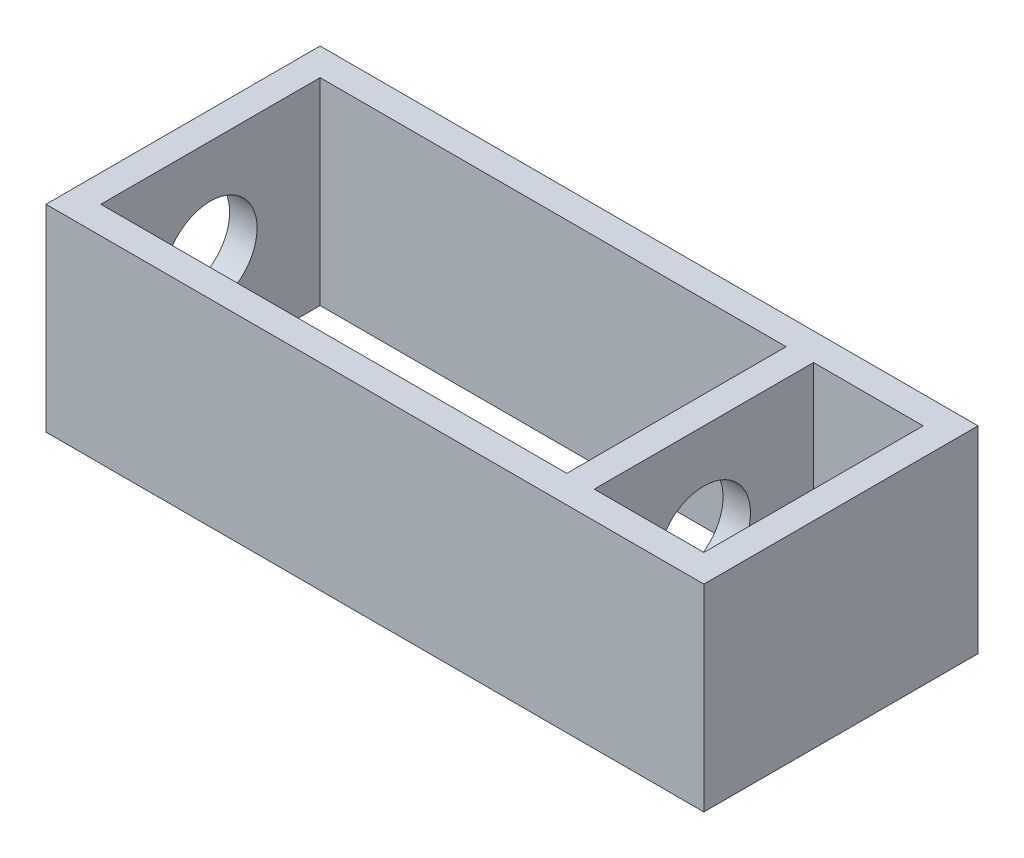
ISO-10303-21;
HEADER;
FILE_DESCRIPTION(('STEP AP214'),'2;1');
FILE_NAME('part.step','',(''),(''),'','','');
FILE_SCHEMA(('AUTOMOTIVE_DESIGN { 1 0 10303 214 1 1 1 1 }'));
ENDSEC;
DATA;
#1=APPLICATION_CONTEXT('core data for automotive mechanical design processes');
#2=APPLICATION_PROTOCOL_DEFINITION('international standard','automotive_design',2000,#1);
#3=PRODUCT_CONTEXT('',#1,'mechanical');
#4=PRODUCT('Part','Part','',(#3));
#5=PRODUCT_RELATED_PRODUCT_CATEGORY('part','',(#4));
#6=PRODUCT_DEFINITION_FORMATION('','',#4);
#7=PRODUCT_DEFINITION_CONTEXT('part definition',#1,'design');
#8=PRODUCT_DEFINITION('design','',#6,#7);
#9=PRODUCT_DEFINITION_SHAPE('','',#8);
#10=(LENGTH_UNIT() NAMED_UNIT(*) SI_UNIT(.MILLI.,.METRE.));
#11=(NAMED_UNIT(*) PLANE_ANGLE_UNIT() SI_UNIT($,.RADIAN.));
#12=(NAMED_UNIT(*) SI_UNIT($,.STERADIAN.) SOLID_ANGLE_UNIT());
#13=UNCERTAINTY_MEASURE_WITH_UNIT(LENGTH_MEASURE(1.E-05),#10,'distance_accuracy_value','');
#14=(GEOMETRIC_REPRESENTATION_CONTEXT(3) GLOBAL_UNCERTAINTY_ASSIGNED_CONTEXT((#13)) GLOBAL_UNIT_ASSIGNED_CONTEXT((#10,
#11,#12)) REPRESENTATION_CONTEXT('',''));
#15=CARTESIAN_POINT('',(0.,0.,0.));
#16=DIRECTION('',(0.,0.,1.));
#17=DIRECTION('',(1.,0.,0.));
#18=AXIS2_PLACEMENT_3D('',#15,#16,#17);
#19=CARTESIAN_POINT('',(0.,18.,0.));
#20=DIRECTION('',(0.,-1.,0.));
#21=DIRECTION('',(0.,0.,-1.));
#22=AXIS2_PLACEMENT_3D('',#19,#20,#21);
#23=PLANE('',#22);
#24=DIRECTION('',(0.,0.,1.));
#25=VECTOR('',#24,1.);
#26=CARTESIAN_POINT('',(-20.,18.,10.));
#27=LINE('',#26,#25);
#28=CARTESIAN_POINT('',(-20.,18.,-10.));
#29=VERTEX_POINT('',#28);
#30=CARTESIAN_POINT('',(-20.,18.,10.));
#31=VERTEX_POINT('',#30);
#32=EDGE_CURVE('E160',#29,#31,#27,.T.);
#33=ORIENTED_EDGE('',*,*,#32,.F.);
#34=DIRECTION('',(-1.,0.,0.));
#35=VECTOR('',#34,1.);
#36=CARTESIAN_POINT('',(22.5,18.,-10.));
#37=LINE('',#36,#35);
#38=CARTESIAN_POINT('',(22.5,18.,-10.));
#39=VERTEX_POINT('',#38);
#40=EDGE_CURVE('E168',#39,#29,#37,.T.);
#41=ORIENTED_EDGE('',*,*,#40,.F.);
#42=DIRECTION('',(0.,0.,-1.));
#43=VECTOR('',#42,1.);
#44=CARTESIAN_POINT('',(22.5,18.,10.));
#45=LINE('',#44,#43);
#46=CARTESIAN_POINT('',(22.5,18.,10.));
#47=VERTEX_POINT('',#46);
#48=EDGE_CURVE('E165',#47,#39,#45,.T.);
#49=ORIENTED_EDGE('',*,*,#48,.F.);
#50=DIRECTION('',(1.,0.,0.));
#51=VECTOR('',#50,1.);
#52=CARTESIAN_POINT('',(22.5,18.,10.));
#53=LINE('',#52,#51);
#54=EDGE_CURVE('E162',#31,#47,#53,.T.);
#55=ORIENTED_EDGE('',*,*,#54,.F.);
#56=EDGE_LOOP('',(#33,#41,#49,#55));
#57=FACE_BOUND('',#56,.T.);
#58=DIRECTION('',(0.,0.,1.));
#59=VECTOR('',#58,1.);
#60=CARTESIAN_POINT('',(-22.5,18.,12.5));
#61=LINE('',#60,#59);
#62=CARTESIAN_POINT('',(-22.5,18.,-12.5));
#63=VERTEX_POINT('',#62);
#64=CARTESIAN_POINT('',(-22.5,18.,12.5));
#65=VERTEX_POINT('',#64);
#66=EDGE_CURVE('E191',#63,#65,#61,.T.);
#67=ORIENTED_EDGE('',*,*,#66,.T.);
#68=DIRECTION('',(1.,0.,0.));
#69=VECTOR('',#68,1.);
#70=CARTESIAN_POINT('',(-22.5,18.,12.5));
#71=LINE('',#70,#69);
#72=CARTESIAN_POINT('',(37.5,18.,12.5));
#73=VERTEX_POINT('',#72);
#74=EDGE_CURVE('E194',#65,#73,#71,.T.);
#75=ORIENTED_EDGE('',*,*,#74,.T.);
#76=DIRECTION('',(0.,0.,-1.));
#77=VECTOR('',#76,1.);
#78=CARTESIAN_POINT('',(37.5,18.,12.5));
#79=LINE('',#78,#77);
#80=CARTESIAN_POINT('',(37.5,18.,-12.5));
#81=VERTEX_POINT('',#80);
#82=EDGE_CURVE('E197',#73,#81,#79,.T.);
#83=ORIENTED_EDGE('',*,*,#82,.T.);
#84=DIRECTION('',(-1.,0.,0.));
#85=VECTOR('',#84,1.);
#86=CARTESIAN_POINT('',(-22.5,18.,-12.5));
#87=LINE('',#86,#85);
#88=EDGE_CURVE('E199',#81,#63,#87,.T.);
#89=ORIENTED_EDGE('',*,*,#88,.T.);
#90=EDGE_LOOP('',(#67,#75,#83,#89));
#91=FACE_BOUND('',#90,.T.);
#92=DIRECTION('',(0.,0.,1.));
#93=VECTOR('',#92,1.);
#94=CARTESIAN_POINT('',(25.,18.,10.));
#95=LINE('',#94,#93);
#96=CARTESIAN_POINT('',(25.,18.,-10.));
#97=VERTEX_POINT('',#96);
#98=CARTESIAN_POINT('',(25.,18.,10.));
#99=VERTEX_POINT('',#98);
#100=EDGE_CURVE('E122',#97,#99,#95,.T.);
#101=ORIENTED_EDGE('',*,*,#100,.F.);
#102=DIRECTION('',(-1.,0.,0.));
#103=VECTOR('',#102,1.);
#104=CARTESIAN_POINT('',(35.,18.,-10.));
#105=LINE('',#104,#103);
#106=CARTESIAN_POINT('',(35.,18.,-10.));
#107=VERTEX_POINT('',#106);
#108=EDGE_CURVE('E144',#107,#97,#105,.T.);
#109=ORIENTED_EDGE('',*,*,#108,.F.);
#110=DIRECTION('',(0.,0.,-1.));
#111=VECTOR('',#110,1.);
#112=CARTESIAN_POINT('',(35.,18.,10.));
#113=LINE('',#112,#111);
#114=CARTESIAN_POINT('',(35.,18.,10.));
#115=VERTEX_POINT('',#114);
#116=EDGE_CURVE('E142',#115,#107,#113,.T.);
#117=ORIENTED_EDGE('',*,*,#116,.F.);
#118=DIRECTION('',(1.,0.,0.));
#119=VECTOR('',#118,1.);
#120=CARTESIAN_POINT('',(35.,18.,10.));
#121=LINE('',#120,#119);
#122=EDGE_CURVE('E130',#99,#115,#121,.T.);
#123=ORIENTED_EDGE('',*,*,#122,.F.);
#124=EDGE_LOOP('',(#101,#109,#117,#123));
#125=FACE_BOUND('',#124,.T.);
#126=ADVANCED_FACE('F33',(#57,#91,#125),#23,.F.);
#127=CARTESIAN_POINT('',(0.,0.,0.));
#128=DIRECTION('',(0.,-1.,0.));
#129=DIRECTION('',(0.,0.,-1.));
#130=AXIS2_PLACEMENT_3D('',#127,#128,#129);
#131=PLANE('',#130);
#132=DIRECTION('',(-1.,0.,0.));
#133=VECTOR('',#132,1.);
#134=CARTESIAN_POINT('',(22.5,0.,-10.));
#135=LINE('',#134,#133);
#136=CARTESIAN_POINT('',(22.5,0.,-10.));
#137=VERTEX_POINT('',#136);
#138=CARTESIAN_POINT('',(-20.,0.,-10.));
#139=VERTEX_POINT('',#138);
#140=EDGE_CURVE('E163',#137,#139,#135,.T.);
#141=ORIENTED_EDGE('',*,*,#140,.T.);
#142=DIRECTION('',(0.,0.,1.));
#143=VECTOR('',#142,1.);
#144=CARTESIAN_POINT('',(-20.,0.,10.));
#145=LINE('',#144,#143);
#146=CARTESIAN_POINT('',(-20.,0.,10.));
#147=VERTEX_POINT('',#146);
#148=EDGE_CURVE('E138',#139,#147,#145,.T.);
#149=ORIENTED_EDGE('',*,*,#148,.T.);
#150=DIRECTION('',(1.,0.,0.));
#151=VECTOR('',#150,1.);
#152=CARTESIAN_POINT('',(22.5,0.,10.));
#153=LINE('',#152,#151);
#154=CARTESIAN_POINT('',(22.5,0.,10.));
#155=VERTEX_POINT('',#154);
#156=EDGE_CURVE('E173',#147,#155,#153,.T.);
#157=ORIENTED_EDGE('',*,*,#156,.T.);
#158=DIRECTION('',(0.,0.,-1.));
#159=VECTOR('',#158,1.);
#160=CARTESIAN_POINT('',(22.5,0.,10.));
#161=LINE('',#160,#159);
#162=EDGE_CURVE('E176',#155,#137,#161,.T.);
#163=ORIENTED_EDGE('',*,*,#162,.T.);
#164=EDGE_LOOP('',(#141,#149,#157,#163));
#165=FACE_BOUND('',#164,.T.);
#166=DIRECTION('',(0.,0.,1.));
#167=VECTOR('',#166,1.);
#168=CARTESIAN_POINT('',(-22.5,0.,12.5));
#169=LINE('',#168,#167);
#170=CARTESIAN_POINT('',(-22.5,0.,-12.5));
#171=VERTEX_POINT('',#170);
#172=CARTESIAN_POINT('',(-22.5,0.,12.5));
#173=VERTEX_POINT('',#172);
#174=EDGE_CURVE('E190',#171,#173,#169,.T.);
#175=ORIENTED_EDGE('',*,*,#174,.F.);
#176=DIRECTION('',(-1.,0.,0.));
#177=VECTOR('',#176,1.);
#178=CARTESIAN_POINT('',(-22.5,0.,-12.5));
#179=LINE('',#178,#177);
#180=CARTESIAN_POINT('',(37.5,0.,-12.5));
#181=VERTEX_POINT('',#180);
#182=EDGE_CURVE('E195',#181,#171,#179,.T.);
#183=ORIENTED_EDGE('',*,*,#182,.F.);
#184=DIRECTION('',(0.,0.,-1.));
#185=VECTOR('',#184,1.);
#186=CARTESIAN_POINT('',(37.5,0.,12.5));
#187=LINE('',#186,#185);
#188=CARTESIAN_POINT('',(37.5,0.,12.5));
#189=VERTEX_POINT('',#188);
#190=EDGE_CURVE('E206',#189,#181,#187,.T.);
#191=ORIENTED_EDGE('',*,*,#190,.F.);
#192=DIRECTION('',(1.,0.,0.));
#193=VECTOR('',#192,1.);
#194=CARTESIAN_POINT('',(-22.5,0.,12.5));
#195=LINE('',#194,#193);
#196=EDGE_CURVE('E204',#173,#189,#195,.T.);
#197=ORIENTED_EDGE('',*,*,#196,.F.);
#198=EDGE_LOOP('',(#175,#183,#191,#197));
#199=FACE_BOUND('',#198,.T.);
#200=DIRECTION('',(-1.,0.,0.));
#201=VECTOR('',#200,1.);
#202=CARTESIAN_POINT('',(35.,0.,-10.));
#203=LINE('',#202,#201);
#204=CARTESIAN_POINT('',(35.,0.,-10.));
#205=VERTEX_POINT('',#204);
#206=CARTESIAN_POINT('',(25.,0.,-10.));
#207=VERTEX_POINT('',#206);
#208=EDGE_CURVE('E131',#205,#207,#203,.T.);
#209=ORIENTED_EDGE('',*,*,#208,.T.);
#210=DIRECTION('',(0.,0.,1.));
#211=VECTOR('',#210,1.);
#212=CARTESIAN_POINT('',(25.,0.,10.));
#213=LINE('',#212,#211);
#214=CARTESIAN_POINT('',(25.,0.,10.));
#215=VERTEX_POINT('',#214);
#216=EDGE_CURVE('E56',#207,#215,#213,.T.);
#217=ORIENTED_EDGE('',*,*,#216,.T.);
#218=DIRECTION('',(1.,0.,0.));
#219=VECTOR('',#218,1.);
#220=CARTESIAN_POINT('',(35.,0.,10.));
#221=LINE('',#220,#219);
#222=CARTESIAN_POINT('',(35.,0.,10.));
#223=VERTEX_POINT('',#222);
#224=EDGE_CURVE('E137',#215,#223,#221,.T.);
#225=ORIENTED_EDGE('',*,*,#224,.T.);
#226=DIRECTION('',(0.,0.,-1.));
#227=VECTOR('',#226,1.);
#228=CARTESIAN_POINT('',(35.,0.,10.));
#229=LINE('',#228,#227);
#230=EDGE_CURVE('E152',#223,#205,#229,.T.);
#231=ORIENTED_EDGE('',*,*,#230,.T.);
#232=EDGE_LOOP('',(#209,#217,#225,#231));
#233=FACE_BOUND('',#232,.T.);
#234=ADVANCED_FACE('F224',(#165,#199,#233),#131,.T.);
#235=CARTESIAN_POINT('',(-22.5,18.,12.5));
#236=DIRECTION('',(1.,0.,0.));
#237=DIRECTION('',(0.,0.,-1.));
#238=AXIS2_PLACEMENT_3D('',#235,#236,#237);
#239=PLANE('',#238);
#240=CARTESIAN_POINT('',(-22.5,9.,0.));
#241=DIRECTION('',(-1.,0.,0.));
#242=DIRECTION('',(0.,0.,1.));
#243=AXIS2_PLACEMENT_3D('',#240,#241,#242);
#244=CIRCLE('',#243,4.25);
#245=CARTESIAN_POINT('',(-22.5,9.,4.25));
#246=VERTEX_POINT('',#245);
#247=EDGE_CURVE('E315',#246,#246,#244,.T.);
#248=ORIENTED_EDGE('',*,*,#247,.F.);
#249=EDGE_LOOP('',(#248));
#250=FACE_BOUND('',#249,.T.);
#251=ORIENTED_EDGE('',*,*,#174,.T.);
#252=DIRECTION('',(0.,-1.,0.));
#253=VECTOR('',#252,1.);
#254=CARTESIAN_POINT('',(-22.5,18.,12.5));
#255=LINE('',#254,#253);
#256=EDGE_CURVE('E11',#65,#173,#255,.T.);
#257=ORIENTED_EDGE('',*,*,#256,.F.);
#258=ORIENTED_EDGE('',*,*,#66,.F.);
#259=DIRECTION('',(0.,-1.,0.));
#260=VECTOR('',#259,1.);
#261=CARTESIAN_POINT('',(-22.5,18.,-12.5));
#262=LINE('',#261,#260);
#263=EDGE_CURVE('E201',#63,#171,#262,.T.);
#264=ORIENTED_EDGE('',*,*,#263,.T.);
#265=EDGE_LOOP('',(#251,#257,#258,#264));
#266=FACE_BOUND('',#265,.T.);
#267=ADVANCED_FACE('F35',(#250,#266),#239,.F.);
#268=CARTESIAN_POINT('',(-22.5,18.,12.5));
#269=DIRECTION('',(0.,0.,-1.));
#270=DIRECTION('',(-1.,0.,0.));
#271=AXIS2_PLACEMENT_3D('',#268,#269,#270);
#272=PLANE('',#271);
#273=ORIENTED_EDGE('',*,*,#196,.T.);
#274=DIRECTION('',(0.,-1.,0.));
#275=VECTOR('',#274,1.);
#276=CARTESIAN_POINT('',(37.5,18.,12.5));
#277=LINE('',#276,#275);
#278=EDGE_CURVE('E41',#73,#189,#277,.T.);
#279=ORIENTED_EDGE('',*,*,#278,.F.);
#280=ORIENTED_EDGE('',*,*,#74,.F.);
#281=ORIENTED_EDGE('',*,*,#256,.T.);
#282=EDGE_LOOP('',(#273,#279,#280,#281));
#283=FACE_BOUND('',#282,.T.);
#284=ADVANCED_FACE('F234',(#283),#272,.F.);
#285=CARTESIAN_POINT('',(37.5,18.,12.5));
#286=DIRECTION('',(-1.,0.,0.));
#287=DIRECTION('',(0.,0.,1.));
#288=AXIS2_PLACEMENT_3D('',#285,#286,#287);
#289=PLANE('',#288);
#290=ORIENTED_EDGE('',*,*,#190,.T.);
#291=DIRECTION('',(0.,-1.,0.));
#292=VECTOR('',#291,1.);
#293=CARTESIAN_POINT('',(37.5,18.,-12.5));
#294=LINE('',#293,#292);
#295=EDGE_CURVE('E211',#81,#181,#294,.T.);
#296=ORIENTED_EDGE('',*,*,#295,.F.);
#297=ORIENTED_EDGE('',*,*,#82,.F.);
#298=ORIENTED_EDGE('',*,*,#278,.T.);
#299=EDGE_LOOP('',(#290,#296,#297,#298));
#300=FACE_BOUND('',#299,.T.);
#301=ADVANCED_FACE('F218',(#300),#289,.F.);
#302=CARTESIAN_POINT('',(-22.5,18.,-12.5));
#303=DIRECTION('',(0.,0.,1.));
#304=DIRECTION('',(1.,0.,0.));
#305=AXIS2_PLACEMENT_3D('',#302,#303,#304);
#306=PLANE('',#305);
#307=ORIENTED_EDGE('',*,*,#182,.T.);
#308=ORIENTED_EDGE('',*,*,#263,.F.);
#309=ORIENTED_EDGE('',*,*,#88,.F.);
#310=ORIENTED_EDGE('',*,*,#295,.T.);
#311=EDGE_LOOP('',(#307,#308,#309,#310));
#312=FACE_BOUND('',#311,.T.);
#313=ADVANCED_FACE('F228',(#312),#306,.F.);
#314=CARTESIAN_POINT('',(-20.,18.,10.));
#315=DIRECTION('',(1.,0.,0.));
#316=DIRECTION('',(0.,0.,-1.));
#317=AXIS2_PLACEMENT_3D('',#314,#315,#316);
#318=PLANE('',#317);
#319=CARTESIAN_POINT('',(-20.,9.,0.));
#320=DIRECTION('',(1.,0.,0.));
#321=DIRECTION('',(0.,0.,-1.));
#322=AXIS2_PLACEMENT_3D('',#319,#320,#321);
#323=CIRCLE('',#322,4.25);
#324=CARTESIAN_POINT('',(-20.,9.,-4.25));
#325=VERTEX_POINT('',#324);
#326=EDGE_CURVE('E150',#325,#325,#323,.T.);
#327=ORIENTED_EDGE('',*,*,#326,.F.);
#328=EDGE_LOOP('',(#327));
#329=FACE_BOUND('',#328,.T.);
#330=ORIENTED_EDGE('',*,*,#148,.F.);
#331=DIRECTION('',(0.,-1.,0.));
#332=VECTOR('',#331,1.);
#333=CARTESIAN_POINT('',(-20.,18.,-10.));
#334=LINE('',#333,#332);
#335=EDGE_CURVE('E170',#29,#139,#334,.T.);
#336=ORIENTED_EDGE('',*,*,#335,.F.);
#337=ORIENTED_EDGE('',*,*,#32,.T.);
#338=DIRECTION('',(0.,-1.,0.));
#339=VECTOR('',#338,1.);
#340=CARTESIAN_POINT('',(-20.,18.,10.));
#341=LINE('',#340,#339);
#342=EDGE_CURVE('E187',#31,#147,#341,.T.);
#343=ORIENTED_EDGE('',*,*,#342,.T.);
#344=EDGE_LOOP('',(#330,#336,#337,#343));
#345=FACE_BOUND('',#344,.T.);
#346=ADVANCED_FACE('F252',(#329,#345),#318,.T.);
#347=CARTESIAN_POINT('',(22.5,18.,10.));
#348=DIRECTION('',(0.,0.,-1.));
#349=DIRECTION('',(-1.,0.,0.));
#350=AXIS2_PLACEMENT_3D('',#347,#348,#349);
#351=PLANE('',#350);
#352=ORIENTED_EDGE('',*,*,#156,.F.);
#353=ORIENTED_EDGE('',*,*,#342,.F.);
#354=ORIENTED_EDGE('',*,*,#54,.T.);
#355=DIRECTION('',(0.,-1.,0.));
#356=VECTOR('',#355,1.);
#357=CARTESIAN_POINT('',(22.5,18.,10.));
#358=LINE('',#357,#356);
#359=EDGE_CURVE('E185',#47,#155,#358,.T.);
#360=ORIENTED_EDGE('',*,*,#359,.T.);
#361=EDGE_LOOP('',(#352,#353,#354,#360));
#362=FACE_BOUND('',#361,.T.);
#363=ADVANCED_FACE('F259',(#362),#351,.T.);
#364=CARTESIAN_POINT('',(22.5,18.,10.));
#365=DIRECTION('',(-1.,0.,0.));
#366=DIRECTION('',(0.,0.,1.));
#367=AXIS2_PLACEMENT_3D('',#364,#365,#366);
#368=PLANE('',#367);
#369=CARTESIAN_POINT('',(22.5,9.,0.));
#370=DIRECTION('',(-1.,0.,0.));
#371=DIRECTION('',(0.,0.,1.));
#372=AXIS2_PLACEMENT_3D('',#369,#370,#371);
#373=CIRCLE('',#372,4.25);
#374=CARTESIAN_POINT('',(22.5,9.,4.25));
#375=VERTEX_POINT('',#374);
#376=EDGE_CURVE('E311',#375,#375,#373,.T.);
#377=ORIENTED_EDGE('',*,*,#376,.F.);
#378=EDGE_LOOP('',(#377));
#379=FACE_BOUND('',#378,.T.);
#380=ORIENTED_EDGE('',*,*,#162,.F.);
#381=ORIENTED_EDGE('',*,*,#359,.F.);
#382=ORIENTED_EDGE('',*,*,#48,.T.);
#383=DIRECTION('',(0.,-1.,0.));
#384=VECTOR('',#383,1.);
#385=CARTESIAN_POINT('',(22.5,18.,-10.));
#386=LINE('',#385,#384);
#387=EDGE_CURVE('E183',#39,#137,#386,.T.);
#388=ORIENTED_EDGE('',*,*,#387,.T.);
#389=EDGE_LOOP('',(#380,#381,#382,#388));
#390=FACE_BOUND('',#389,.T.);
#391=ADVANCED_FACE('F264',(#379,#390),#368,.T.);
#392=CARTESIAN_POINT('',(22.5,18.,-10.));
#393=DIRECTION('',(0.,0.,1.));
#394=DIRECTION('',(1.,0.,0.));
#395=AXIS2_PLACEMENT_3D('',#392,#393,#394);
#396=PLANE('',#395);
#397=ORIENTED_EDGE('',*,*,#140,.F.);
#398=ORIENTED_EDGE('',*,*,#387,.F.);
#399=ORIENTED_EDGE('',*,*,#40,.T.);
#400=ORIENTED_EDGE('',*,*,#335,.T.);
#401=EDGE_LOOP('',(#397,#398,#399,#400));
#402=FACE_BOUND('',#401,.T.);
#403=ADVANCED_FACE('F273',(#402),#396,.T.);
#404=CARTESIAN_POINT('',(25.,18.,10.));
#405=DIRECTION('',(1.,0.,0.));
#406=DIRECTION('',(0.,0.,-1.));
#407=AXIS2_PLACEMENT_3D('',#404,#405,#406);
#408=PLANE('',#407);
#409=CARTESIAN_POINT('',(25.,9.,0.));
#410=DIRECTION('',(1.,0.,0.));
#411=DIRECTION('',(0.,0.,-1.));
#412=AXIS2_PLACEMENT_3D('',#409,#410,#411);
#413=CIRCLE('',#412,4.25);
#414=CARTESIAN_POINT('',(25.,9.,-4.25));
#415=VERTEX_POINT('',#414);
#416=EDGE_CURVE('E314',#415,#415,#413,.F.);
#417=ORIENTED_EDGE('',*,*,#416,.T.);
#418=EDGE_LOOP('',(#417));
#419=FACE_BOUND('',#418,.T.);
#420=ORIENTED_EDGE('',*,*,#216,.F.);
#421=DIRECTION('',(0.,-1.,0.));
#422=VECTOR('',#421,1.);
#423=CARTESIAN_POINT('',(25.,18.,-10.));
#424=LINE('',#423,#422);
#425=EDGE_CURVE('E126',#97,#207,#424,.T.);
#426=ORIENTED_EDGE('',*,*,#425,.F.);
#427=ORIENTED_EDGE('',*,*,#100,.T.);
#428=DIRECTION('',(0.,-1.,0.));
#429=VECTOR('',#428,1.);
#430=CARTESIAN_POINT('',(25.,18.,10.));
#431=LINE('',#430,#429);
#432=EDGE_CURVE('E125',#99,#215,#431,.T.);
#433=ORIENTED_EDGE('',*,*,#432,.T.);
#434=EDGE_LOOP('',(#420,#426,#427,#433));
#435=FACE_BOUND('',#434,.T.);
#436=ADVANCED_FACE('F124',(#419,#435),#408,.T.);
#437=CARTESIAN_POINT('',(35.,18.,10.));
#438=DIRECTION('',(0.,0.,-1.));
#439=DIRECTION('',(-1.,0.,0.));
#440=AXIS2_PLACEMENT_3D('',#437,#438,#439);
#441=PLANE('',#440);
#442=ORIENTED_EDGE('',*,*,#224,.F.);
#443=ORIENTED_EDGE('',*,*,#432,.F.);
#444=ORIENTED_EDGE('',*,*,#122,.T.);
#445=DIRECTION('',(0.,-1.,0.));
#446=VECTOR('',#445,1.);
#447=CARTESIAN_POINT('',(35.,18.,10.));
#448=LINE('',#447,#446);
#449=EDGE_CURVE('E139',#115,#223,#448,.T.);
#450=ORIENTED_EDGE('',*,*,#449,.T.);
#451=EDGE_LOOP('',(#442,#443,#444,#450));
#452=FACE_BOUND('',#451,.T.);
#453=ADVANCED_FACE('F134',(#452),#441,.T.);
#454=CARTESIAN_POINT('',(35.,18.,10.));
#455=DIRECTION('',(-1.,0.,0.));
#456=DIRECTION('',(0.,0.,1.));
#457=AXIS2_PLACEMENT_3D('',#454,#455,#456);
#458=PLANE('',#457);
#459=ORIENTED_EDGE('',*,*,#230,.F.);
#460=ORIENTED_EDGE('',*,*,#449,.F.);
#461=ORIENTED_EDGE('',*,*,#116,.T.);
#462=DIRECTION('',(0.,-1.,0.));
#463=VECTOR('',#462,1.);
#464=CARTESIAN_POINT('',(35.,18.,-10.));
#465=LINE('',#464,#463);
#466=EDGE_CURVE('E48',#107,#205,#465,.T.);
#467=ORIENTED_EDGE('',*,*,#466,.T.);
#468=EDGE_LOOP('',(#459,#460,#461,#467));
#469=FACE_BOUND('',#468,.T.);
#470=ADVANCED_FACE('F294',(#469),#458,.T.);
#471=CARTESIAN_POINT('',(35.,18.,-10.));
#472=DIRECTION('',(0.,0.,1.));
#473=DIRECTION('',(1.,0.,0.));
#474=AXIS2_PLACEMENT_3D('',#471,#472,#473);
#475=PLANE('',#474);
#476=ORIENTED_EDGE('',*,*,#208,.F.);
#477=ORIENTED_EDGE('',*,*,#466,.F.);
#478=ORIENTED_EDGE('',*,*,#108,.T.);
#479=ORIENTED_EDGE('',*,*,#425,.T.);
#480=EDGE_LOOP('',(#476,#477,#478,#479));
#481=FACE_BOUND('',#480,.T.);
#482=ADVANCED_FACE('F297',(#481),#475,.T.);
#483=CARTESIAN_POINT('',(37.0208152801713,9.,0.));
#484=DIRECTION('',(-1.,0.,0.));
#485=DIRECTION('',(0.,0.,1.));
#486=AXIS2_PLACEMENT_3D('',#483,#484,#485);
#487=CYLINDRICAL_SURFACE('',#486,4.25);
#488=ORIENTED_EDGE('',*,*,#376,.T.);
#489=EDGE_LOOP('',(#488));
#490=FACE_BOUND('',#489,.T.);
#491=ORIENTED_EDGE('',*,*,#416,.F.);
#492=EDGE_LOOP('',(#491));
#493=FACE_BOUND('',#492,.T.);
#494=ADVANCED_FACE('F301',(#490,#493),#487,.F.);
#495=ORIENTED_EDGE('',*,*,#326,.T.);
#496=EDGE_LOOP('',(#495));
#497=FACE_BOUND('',#496,.T.);
#498=ORIENTED_EDGE('',*,*,#247,.T.);
#499=EDGE_LOOP('',(#498));
#500=FACE_BOUND('',#499,.T.);
#501=ADVANCED_FACE('F303',(#497,#500),#487,.F.);
#502=CLOSED_SHELL('',(#126,#234,#267,#284,#301,#313,#346,#363,#391,#403,#436,#453,#470,#482,
#494,#501));
#503=MANIFOLD_SOLID_BREP('B2',#502);
#504=ADVANCED_BREP_SHAPE_REPRESENTATION('',(#18,#503),#14);
#505=SHAPE_DEFINITION_REPRESENTATION(#9,#504);
ENDSEC;
END-ISO-10303-21;
